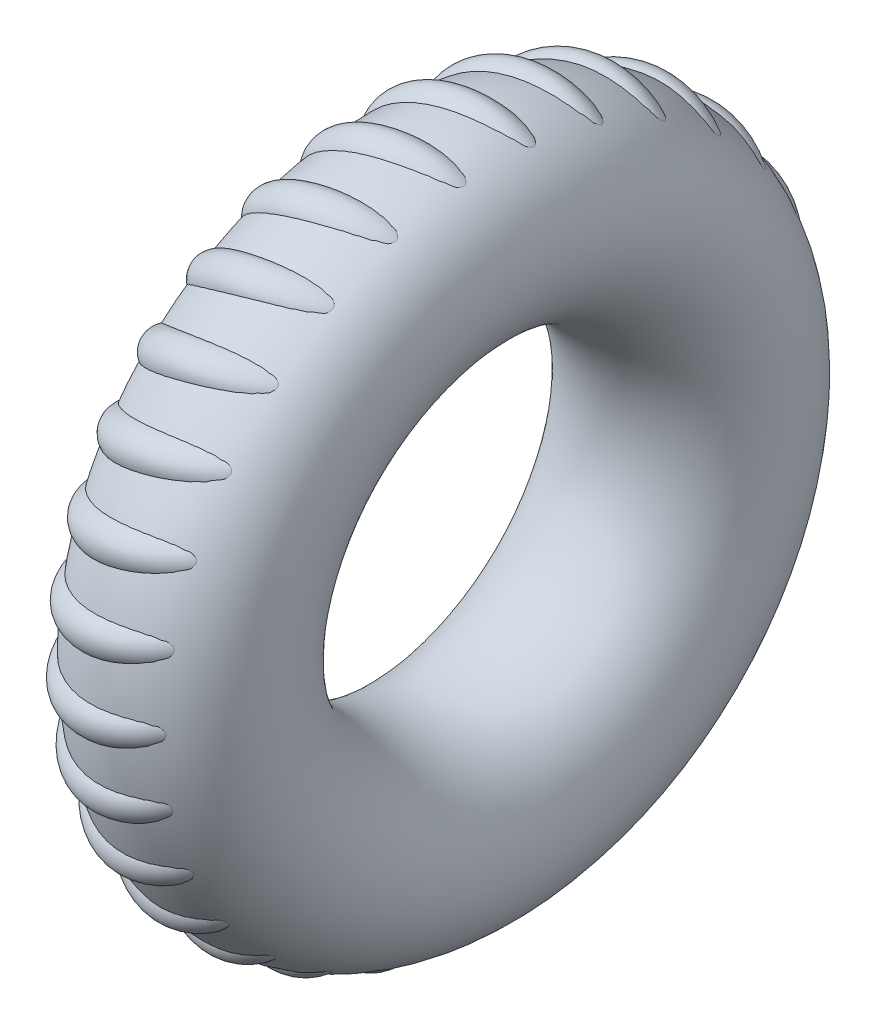
ISO-10303-21;
HEADER;
FILE_DESCRIPTION(('STEP AP214'),'2;1');
FILE_NAME('part.step','',(''),(''),'','','');
FILE_SCHEMA(('AUTOMOTIVE_DESIGN { 1 0 10303 214 1 1 1 1 }'));
ENDSEC;
DATA;
#1=APPLICATION_CONTEXT('core data for automotive mechanical design processes');
#2=APPLICATION_PROTOCOL_DEFINITION('international standard','automotive_design',2000,#1);
#3=PRODUCT_CONTEXT('',#1,'mechanical');
#4=PRODUCT('Part','Part','',(#3));
#5=PRODUCT_RELATED_PRODUCT_CATEGORY('part','',(#4));
#6=PRODUCT_DEFINITION_FORMATION('','',#4);
#7=PRODUCT_DEFINITION_CONTEXT('part definition',#1,'design');
#8=PRODUCT_DEFINITION('design','',#6,#7);
#9=PRODUCT_DEFINITION_SHAPE('','',#8);
#10=(LENGTH_UNIT() NAMED_UNIT(*) SI_UNIT(.MILLI.,.METRE.));
#11=(NAMED_UNIT(*) PLANE_ANGLE_UNIT() SI_UNIT($,.RADIAN.));
#12=(NAMED_UNIT(*) SI_UNIT($,.STERADIAN.) SOLID_ANGLE_UNIT());
#13=UNCERTAINTY_MEASURE_WITH_UNIT(LENGTH_MEASURE(1.E-05),#10,'distance_accuracy_value','');
#14=(GEOMETRIC_REPRESENTATION_CONTEXT(3) GLOBAL_UNCERTAINTY_ASSIGNED_CONTEXT((#13)) GLOBAL_UNIT_ASSIGNED_CONTEXT((#10,
#11,#12)) REPRESENTATION_CONTEXT('',''));
#15=CARTESIAN_POINT('',(0.,0.,0.));
#16=DIRECTION('',(0.,0.,1.));
#17=DIRECTION('',(1.,0.,0.));
#18=AXIS2_PLACEMENT_3D('',#15,#16,#17);
#19=CARTESIAN_POINT('',(-0.0197356871410002,0.807315676540417,-0.286027395869328));
#20=DIRECTION('',(0.171928492592131,0.065406256549393,0.982935712566803));
#21=DIRECTION('',(-0.0243779212002062,-0.997205374978762,0.0706198065095151));
#22=AXIS2_PLACEMENT_3D('',#19,#20,#21);
#23=TOROIDAL_SURFACE('',#22,0.234974875549106,0.0673045788176516);
#24=CARTESIAN_POINT('',(-0.0271046318599944,0.505880979900239,-0.264680479290146));
#25=VERTEX_POINT('',#24);
#26=VERTEX_LOOP('',#25);
#27=FACE_BOUND('',#26,.T.);
#28=ADVANCED_FACE('F47',(#27),#23,.T.);
#29=CLOSED_SHELL('',(#28));
#30=MANIFOLD_SOLID_BREP('B2',#29);
#31=CARTESIAN_POINT('',(-0.0197356871410384,0.730205452547386,-0.447627378346935));
#32=DIRECTION('',(0.171928492592131,0.268340798881693,0.94785748353355));
#33=DIRECTION('',(-0.0243779212002065,-0.960731361597714,0.276407249905959));
#34=AXIS2_PLACEMENT_3D('',#31,#32,#33);
#35=TOROIDAL_SURFACE('',#34,0.234974875549106,0.0673045788176516);
#36=CARTESIAN_POINT('',(-0.0271046318600326,0.439796100770597,-0.364075145662345));
#37=VERTEX_POINT('',#36);
#38=VERTEX_LOOP('',#37);
#39=FACE_BOUND('',#38,.T.);
#40=ADVANCED_FACE('F71',(#39),#35,.T.);
#41=CLOSED_SHELL('',(#40));
#42=MANIFOLD_SOLID_BREP('B6',#41);
#43=CARTESIAN_POINT('',(-0.0197356871409898,0.621181746363532,-0.589663896436287));
#44=DIRECTION('',(0.171928492592131,0.459547560660848,0.87135333414505));
#45=DIRECTION('',(-0.0243779212002064,-0.882268777614285,0.470114370132374));
#46=AXIS2_PLACEMENT_3D('',#43,#44,#45);
#47=TOROIDAL_SURFACE('',#46,0.234974875549106,0.0673045788176516);
#48=CARTESIAN_POINT('',(-0.027104631859984,0.35449002166146,-0.447557981142701));
#49=VERTEX_POINT('',#48);
#50=VERTEX_LOOP('',#49);
#51=FACE_BOUND('',#50,.T.);
#52=ADVANCED_FACE('F95',(#51),#47,.T.);
#53=CLOSED_SHELL('',(#52));
#54=MANIFOLD_SOLID_BREP('B43',#53);
#55=CARTESIAN_POINT('',(-0.0197356871409655,0.485009417102854,-0.70592927273007));
#56=DIRECTION('',(0.171928492592131,0.630669888885266,0.756766862837214));
#57=DIRECTION('',(-0.0243779212002064,-0.765246814453812,0.643275236524969));
#58=AXIS2_PLACEMENT_3D('',#55,#56,#57);
#59=TOROIDAL_SURFACE('',#58,0.234974875549106,0.0673045788176516);
#60=CARTESIAN_POINT('',(-0.0271046318599597,0.253691027573857,-0.511480385225655));
#61=VERTEX_POINT('',#60);
#62=VERTEX_LOOP('',#61);
#63=FACE_BOUND('',#62,.T.);
#64=ADVANCED_FACE('F119',(#63),#59,.T.);
#65=CLOSED_SHELL('',(#64));
#66=MANIFOLD_SOLID_BREP('B67',#65);
#67=CARTESIAN_POINT('',(-0.0197356871410211,0.327639848981404,-0.791342152381086));
#68=DIRECTION('',(0.171928492592131,0.774228916675515,0.609106048253082));
#69=DIRECTION('',(-0.0243779212002065,-0.614779893440078,0.788321888304371));
#70=AXIS2_PLACEMENT_3D('',#67,#68,#69);
#71=TOROIDAL_SURFACE('',#70,0.234974875549106,0.0673045788176516);
#72=CARTESIAN_POINT('',(-0.0271046318600153,0.141804518236684,-0.553048642119069));
#73=VERTEX_POINT('',#72);
#74=VERTEX_LOOP('',#73);
#75=FACE_BOUND('',#74,.T.);
#76=ADVANCED_FACE('F143',(#75),#71,.T.);
#77=CLOSED_SHELL('',(#76));
#78=MANIFOLD_SOLID_BREP('B91',#77);
#79=CARTESIAN_POINT('',(-0.0197356871410419,0.155950847269049,-0.842169582692097));
#80=DIRECTION('',(0.171928492592131,0.883950425644513,0.434824376545198));
#81=DIRECTION('',(-0.0243779212002064,-0.437444141041786,0.898915090776753));
#82=AXIS2_PLACEMENT_3D('',#79,#80,#81);
#83=TOROIDAL_SURFACE('',#82,0.234974875549106,0.0673045788176516);
#84=CARTESIAN_POINT('',(-0.0271046318600361,0.0237204709990027,-0.570446019530056));
#85=VERTEX_POINT('',#84);
#86=VERTEX_LOOP('',#85);
#87=FACE_BOUND('',#86,.T.);
#88=ADVANCED_FACE('F167',(#87),#83,.T.);
#89=CLOSED_SHELL('',(#88));
#90=MANIFOLD_SOLID_BREP('B115',#89);
#91=CARTESIAN_POINT('',(-0.019735687141028,-0.0225539548041886,-0.856190161061435));
#92=DIRECTION('',(0.171928492592131,0.955039059348089,0.241538793063432));
#93=DIRECTION('',(-0.0243779212002064,-0.240989980590085,0.970221390309017));
#94=AXIS2_PLACEMENT_3D('',#91,#92,#93);
#95=TOROIDAL_SURFACE('',#94,0.234974875549106,0.0673045788176516);
#96=CARTESIAN_POINT('',(-0.0271046318600222,-0.0954002746448148,-0.562912168583868));
#97=VERTEX_POINT('',#96);
#98=VERTEX_LOOP('',#97);
#99=FACE_BOUND('',#98,.T.);
#100=ADVANCED_FACE('F191',(#99),#95,.T.);
#101=CLOSED_SHELL('',(#100));
#102=MANIFOLD_SOLID_BREP('B139',#101);
#103=CARTESIAN_POINT('',(-0.0197356871410211,-0.200073040826566,-0.83279112093616));
#104=DIRECTION('',(0.171928492592132,0.984387903372301,0.037696805293071));
#105=DIRECTION('',(-0.0243779212002066,-0.0340034015883718,0.999124359446008));
#106=AXIS2_PLACEMENT_3D('',#103,#104,#105);
#107=TOROIDAL_SURFACE('',#106,0.234974875549106,0.0673045788176516);
#108=CARTESIAN_POINT('',(-0.0271046318600153,-0.210351570505313,-0.530776354718285));
#109=VERTEX_POINT('',#108);
#110=VERTEX_LOOP('',#109);
#111=FACE_BOUND('',#110,.T.);
#112=ADVANCED_FACE('F215',(#111),#107,.T.);
#113=CLOSED_SHELL('',(#112));
#114=MANIFOLD_SOLID_BREP('B163',#113);
#115=CARTESIAN_POINT('',(-0.0197356871410662,-0.368847974907889,-0.77299511265082));
#116=DIRECTION('',(0.171928492592131,0.970714272401901,-0.167792713757937));
#117=DIRECTION('',(-0.0243779212002063,0.174469289229176,0.984360799744611));
#118=AXIS2_PLACEMENT_3D('',#115,#116,#117);
#119=TOROIDAL_SURFACE('',#118,0.234974875549106,0.0673045788176516);
#120=CARTESIAN_POINT('',(-0.0271046318600603,-0.316109493355938,-0.475443067203995));
#121=VERTEX_POINT('',#120);
#122=VERTEX_LOOP('',#121);
#123=FACE_BOUND('',#122,.T.);
#124=ADVANCED_FACE('F239',(#123),#119,.T.);
#125=CLOSED_SHELL('',(#124));
#126=MANIFOLD_SOLID_BREP('B187',#125);
#127=CARTESIAN_POINT('',(-0.0197356871410662,-0.521502482556772,-0.67941550870055));
#128=DIRECTION('',(0.171928492592131,0.914615769723673,-0.365948886058952));
#129=DIRECTION('',(-0.0243779212002063,0.375316834910877,0.926575949607195));
#130=AXIS2_PLACEMENT_3D('',#127,#128,#129);
#131=TOROIDAL_SURFACE('',#130,0.234974875549106,0.0673045788176516);
#132=CARTESIAN_POINT('',(-0.0271046318600603,-0.408051914485254,-0.399330636223927));
#133=VERTEX_POINT('',#132);
#134=VERTEX_LOOP('',#133);
#135=FACE_BOUND('',#134,.T.);
#136=ADVANCED_FACE('F263',(#135),#131,.T.);
#137=CLOSED_SHELL('',(#136));
#138=MANIFOLD_SOLID_BREP('B211',#137);
#139=CARTESIAN_POINT('',(-0.0197356871410488,-0.651364829271361,-0.556142186822745));
#140=DIRECTION('',(0.171928492592132,0.818544169095114,-0.548111336021613));
#141=DIRECTION('',(-0.0243779212002062,0.559761233936978,0.828295284267237));
#142=AXIS2_PLACEMENT_3D('',#139,#140,#141);
#143=TOROIDAL_SURFACE('',#142,0.234974875549106,0.0673045788176516);
#144=CARTESIAN_POINT('',(-0.0271046318600429,-0.482160508901229,-0.305765540239886));
#145=VERTEX_POINT('',#144);
#146=VERTEX_LOOP('',#145);
#147=FACE_BOUND('',#146,.T.);
#148=ADVANCED_FACE('F287',(#147),#143,.T.);
#149=CLOSED_SHELL('',(#148));
#150=MANIFOLD_SOLID_BREP('B235',#149);
#151=CARTESIAN_POINT('',(-0.019735687140976,-0.752759407351554,-0.408562782714491));
#152=DIRECTION('',(0.171928492592131,0.686698260466392,-0.706318690470122));
#153=DIRECTION('',(-0.0243779212002063,0.719741381007625,0.693814140403049));
#154=AXIS2_PLACEMENT_3D('',#151,#152,#153);
#155=TOROIDAL_SURFACE('',#154,0.234974875549106,0.0673045788176516);
#156=CARTESIAN_POINT('',(-0.0271046318599701,-0.535196375415393,-0.198837022921517));
#157=VERTEX_POINT('',#156);
#158=VERTEX_LOOP('',#157);
#159=FACE_BOUND('',#158,.T.);
#160=ADVANCED_FACE('F311',(#159),#155,.T.);
#161=CLOSED_SHELL('',(#160));
#162=MANIFOLD_SOLID_BREP('B259',#161);
#163=CARTESIAN_POINT('',(-0.0197356871410558,-0.821254787190112,-0.243127224499853));
#164=DIRECTION('',(0.171928492592131,0.524840342711451,-0.833656528851984));
#165=DIRECTION('',(-0.0243779212002063,0.848265376025916,0.529009989313627));
#166=AXIS2_PLACEMENT_3D('',#163,#164,#165);
#167=TOROIDAL_SURFACE('',#166,0.234974875549106,0.0673045788176516);
#168=CARTESIAN_POINT('',(-0.0271046318600499,-0.564841592166786,-0.0832183735755656));
#169=VERTEX_POINT('',#168);
#170=VERTEX_LOOP('',#169);
#171=FACE_BOUND('',#170,.T.);
#172=ADVANCED_FACE('F335',(#171),#167,.T.);
#173=CLOSED_SHELL('',(#172));
#174=MANIFOLD_SOLID_BREP('B283',#173);
#175=CARTESIAN_POINT('',(-0.0197356871410176,-0.853857392010743,-0.0670658399207283));
#176=DIRECTION('',(0.171928492592132,0.340044383516628,-0.924559576595148));
#177=DIRECTION('',(-0.0243779212002063,0.939716103682979,0.341085563219633));
#178=AXIS2_PLACEMENT_3D('',#175,#176,#177);
#179=TOROIDAL_SURFACE('',#178,0.234974875549106,0.0673045788176516);
#180=CARTESIAN_POINT('',(-0.0271046318600118,-0.569800520929797,0.0360373180216806));
#181=VERTEX_POINT('',#180);
#182=VERTEX_LOOP('',#181);
#183=FACE_BOUND('',#182,.T.);
#184=ADVANCED_FACE('F359',(#183),#179,.T.);
#185=CLOSED_SHELL('',(#184));
#186=MANIFOLD_SOLID_BREP('B307',#185);
#187=CARTESIAN_POINT('',(-0.0197356871410592,-0.849142331538183,0.111926643680551));
#188=DIRECTION('',(0.17192849259213,0.14038685304814,-0.975054934312033));
#189=DIRECTION('',(-0.0243779212002062,0.990096728350951,0.138254061302813));
#190=AXIS2_PLACEMENT_3D('',#187,#188,#189);
#191=TOROIDAL_SURFACE('',#190,0.234974875549106,0.0673045788176516);
#192=CARTESIAN_POINT('',(-0.0271046318600533,-0.549856432721946,0.153718005895153));
#193=VERTEX_POINT('',#192);
#194=VERTEX_LOOP('',#193);
#195=FACE_BOUND('',#194,.T.);
#196=ADVANCED_FACE('F383',(#195),#191,.T.);
#197=CLOSED_SHELL('',(#196));
#198=MANIFOLD_SOLID_BREP('B331',#197);
#199=CARTESIAN_POINT('',(-0.0197356871409864,-0.80731567654041,0.286027395869329));
#200=DIRECTION('',(0.17192849259213,-0.0654062565494007,-0.982935712566803));
#201=DIRECTION('',(-0.0243779212002061,0.997205374978758,-0.0706198065095193));
#202=AXIS2_PLACEMENT_3D('',#199,#200,#201);
#203=TOROIDAL_SURFACE('',#202,0.234974875549106,0.0673045788176516);
#204=CARTESIAN_POINT('',(-0.0271046318599805,-0.505880979900234,0.264680479290145));
#205=VERTEX_POINT('',#204);
#206=VERTEX_LOOP('',#205);
#207=FACE_BOUND('',#206,.T.);
#208=ADVANCED_FACE('F407',(#207),#203,.T.);
#209=CLOSED_SHELL('',(#208));
#210=MANIFOLD_SOLID_BREP('B355',#209);
#211=CARTESIAN_POINT('',(-0.0197356871409586,-0.730205452547379,0.447627378346934));
#212=DIRECTION('',(0.171928492592131,-0.268340798881699,-0.947857483533548));
#213=DIRECTION('',(-0.0243779212002062,0.960731361597708,-0.276407249905965));
#214=AXIS2_PLACEMENT_3D('',#211,#212,#213);
#215=TOROIDAL_SURFACE('',#214,0.234974875549106,0.0673045788176516);
#216=CARTESIAN_POINT('',(-0.0271046318599527,-0.439796100770592,0.364075145662343));
#217=VERTEX_POINT('',#216);
#218=VERTEX_LOOP('',#217);
#219=FACE_BOUND('',#218,.T.);
#220=ADVANCED_FACE('F431',(#219),#215,.T.);
#221=CLOSED_SHELL('',(#220));
#222=MANIFOLD_SOLID_BREP('B379',#221);
#223=CARTESIAN_POINT('',(-0.0197356871409725,-0.621181746363539,0.589663896436287));
#224=DIRECTION('',(0.171928492592131,-0.459547560660852,-0.871353334145048));
#225=DIRECTION('',(-0.0243779212002062,0.882268777614277,-0.470114370132379));
#226=AXIS2_PLACEMENT_3D('',#223,#224,#225);
#227=TOROIDAL_SURFACE('',#226,0.234974875549106,0.0673045788176516);
#228=CARTESIAN_POINT('',(-0.0271046318599666,-0.35449002166147,0.4475579811427));
#229=VERTEX_POINT('',#228);
#230=VERTEX_LOOP('',#229);
#231=FACE_BOUND('',#230,.T.);
#232=ADVANCED_FACE('F455',(#231),#227,.T.);
#233=CLOSED_SHELL('',(#232));
#234=MANIFOLD_SOLID_BREP('B403',#233);
#235=CARTESIAN_POINT('',(-0.0197356871410349,-0.485009417102882,0.705929272730075));
#236=DIRECTION('',(0.171928492592131,-0.63066988888527,-0.75676686283721));
#237=DIRECTION('',(-0.024377921200206,0.765246814453802,-0.643275236524974));
#238=AXIS2_PLACEMENT_3D('',#235,#236,#237);
#239=TOROIDAL_SURFACE('',#238,0.234974875549106,0.0673045788176516);
#240=CARTESIAN_POINT('',(-0.027104631860029,-0.253691027573887,0.511480385225659));
#241=VERTEX_POINT('',#240);
#242=VERTEX_LOOP('',#241);
#243=FACE_BOUND('',#242,.T.);
#244=ADVANCED_FACE('F479',(#243),#239,.T.);
#245=CLOSED_SHELL('',(#244));
#246=MANIFOLD_SOLID_BREP('B427',#245);
#247=CARTESIAN_POINT('',(-0.0197356871410349,-0.327639848981438,0.791342152381083));
#248=DIRECTION('',(0.171928492592131,-0.774228916675517,-0.609106048253079));
#249=DIRECTION('',(-0.0243779212002061,0.614779893440069,-0.788321888304371));
#250=AXIS2_PLACEMENT_3D('',#247,#248,#249);
#251=TOROIDAL_SURFACE('',#250,0.234974875549106,0.0673045788176516);
#252=CARTESIAN_POINT('',(-0.027104631860029,-0.141804518236721,0.553048642119066));
#253=VERTEX_POINT('',#252);
#254=VERTEX_LOOP('',#253);
#255=FACE_BOUND('',#254,.T.);
#256=ADVANCED_FACE('F503',(#255),#251,.T.);
#257=CLOSED_SHELL('',(#256));
#258=MANIFOLD_SOLID_BREP('B451',#257);
#259=CARTESIAN_POINT('',(-0.0197356871410211,-0.155950847269042,0.842169582692093));
#260=DIRECTION('',(0.171928492592131,-0.883950425644512,-0.434824376545191));
#261=DIRECTION('',(-0.0243779212002063,0.437444141041777,-0.898915090776753));
#262=AXIS2_PLACEMENT_3D('',#259,#260,#261);
#263=TOROIDAL_SURFACE('',#262,0.234974875549106,0.0673045788176516);
#264=CARTESIAN_POINT('',(-0.0271046318600152,-0.0237204709989985,0.570446019530052));
#265=VERTEX_POINT('',#264);
#266=VERTEX_LOOP('',#265);
#267=FACE_BOUND('',#266,.T.);
#268=ADVANCED_FACE('F527',(#267),#263,.T.);
#269=CLOSED_SHELL('',(#268));
#270=MANIFOLD_SOLID_BREP('B475',#269);
#271=CARTESIAN_POINT('',(-0.019735687141028,0.0225539548041817,0.856190161061433));
#272=DIRECTION('',(0.171928492592131,-0.955039059348087,-0.241538793063426));
#273=DIRECTION('',(-0.0243779212002064,0.240989980590075,-0.970221390309017));
#274=AXIS2_PLACEMENT_3D('',#271,#272,#273);
#275=TOROIDAL_SURFACE('',#274,0.234974875549106,0.0673045788176516);
#276=CARTESIAN_POINT('',(-0.0271046318600222,0.0954002746448051,0.562912168583867));
#277=VERTEX_POINT('',#276);
#278=VERTEX_LOOP('',#277);
#279=FACE_BOUND('',#278,.T.);
#280=ADVANCED_FACE('F551',(#279),#275,.T.);
#281=CLOSED_SHELL('',(#280));
#282=MANIFOLD_SOLID_BREP('B499',#281);
#283=CARTESIAN_POINT('',(-0.0197356871410592,0.200073040826573,0.832791120936155));
#284=DIRECTION('',(0.171928492592131,-0.984387903372297,-0.0376968052930659));
#285=DIRECTION('',(-0.0243779212002061,0.0340034015883631,-0.999124359446005));
#286=AXIS2_PLACEMENT_3D('',#283,#284,#285);
#287=TOROIDAL_SURFACE('',#286,0.234974875549106,0.0673045788176516);
#288=CARTESIAN_POINT('',(-0.0271046318600533,0.210351570505317,0.530776354718281));
#289=VERTEX_POINT('',#288);
#290=VERTEX_LOOP('',#289);
#291=FACE_BOUND('',#290,.T.);
#292=ADVANCED_FACE('F575',(#291),#287,.T.);
#293=CLOSED_SHELL('',(#292));
#294=MANIFOLD_SOLID_BREP('B523',#293);
#295=CARTESIAN_POINT('',(-0.0197356871410315,0.368847974907875,0.772995112650809));
#296=DIRECTION('',(0.171928492592131,-0.970714272401894,0.167792713757942));
#297=DIRECTION('',(-0.0243779212002061,-0.174469289229184,-0.984360799744611));
#298=AXIS2_PLACEMENT_3D('',#295,#296,#297);
#299=TOROIDAL_SURFACE('',#298,0.234974875549106,0.0673045788176516);
#300=CARTESIAN_POINT('',(-0.0271046318600256,0.316109493355921,0.475443067203983));
#301=VERTEX_POINT('',#300);
#302=VERTEX_LOOP('',#301);
#303=FACE_BOUND('',#302,.T.);
#304=ADVANCED_FACE('F599',(#303),#299,.T.);
#305=CLOSED_SHELL('',(#304));
#306=MANIFOLD_SOLID_BREP('B547',#305);
#307=CARTESIAN_POINT('',(-0.01973568714091,0.521502482556758,0.679415508700554));
#308=DIRECTION('',(0.171928492592132,-0.914615769723665,0.365948886058955));
#309=DIRECTION('',(-0.0243779212002062,-0.375316834910883,-0.926575949607187));
#310=AXIS2_PLACEMENT_3D('',#307,#308,#309);
#311=TOROIDAL_SURFACE('',#310,0.234974875549106,0.0673045788176516);
#312=CARTESIAN_POINT('',(-0.0271046318599042,0.408051914485239,0.399330636223933));
#313=VERTEX_POINT('',#312);
#314=VERTEX_LOOP('',#313);
#315=FACE_BOUND('',#314,.T.);
#316=ADVANCED_FACE('F623',(#315),#311,.T.);
#317=CLOSED_SHELL('',(#316));
#318=MANIFOLD_SOLID_BREP('B571',#317);
#319=CARTESIAN_POINT('',(-0.0197356871410002,0.651364829271361,0.55614218682273));
#320=DIRECTION('',(0.17192849259213,-0.818544169095105,0.54811133602161));
#321=DIRECTION('',(-0.0243779212002063,-0.559761233936983,-0.828295284267232));
#322=AXIS2_PLACEMENT_3D('',#319,#320,#321);
#323=TOROIDAL_SURFACE('',#322,0.234974875549106,0.0673045788176516);
#324=CARTESIAN_POINT('',(-0.0271046318599944,0.482160508901228,0.305765540239873));
#325=VERTEX_POINT('',#324);
#326=VERTEX_LOOP('',#325);
#327=FACE_BOUND('',#326,.T.);
#328=ADVANCED_FACE('F647',(#327),#323,.T.);
#329=CLOSED_SHELL('',(#328));
#330=MANIFOLD_SOLID_BREP('B595',#329);
#331=CARTESIAN_POINT('',(-0.019735687140976,0.752759407351575,0.408562782714496));
#332=DIRECTION('',(0.171928492592131,-0.686698260466381,0.70631869047012));
#333=DIRECTION('',(-0.0243779212002062,-0.719741381007629,-0.693814140403047));
#334=AXIS2_PLACEMENT_3D('',#331,#332,#333);
#335=TOROIDAL_SURFACE('',#334,0.234974875549106,0.0673045788176516);
#336=CARTESIAN_POINT('',(-0.0271046318599701,0.535196375415412,0.198837022921522));
#337=VERTEX_POINT('',#336);
#338=VERTEX_LOOP('',#337);
#339=FACE_BOUND('',#338,.T.);
#340=ADVANCED_FACE('F671',(#339),#335,.T.);
#341=CLOSED_SHELL('',(#340));
#342=MANIFOLD_SOLID_BREP('B619',#341);
#343=CARTESIAN_POINT('',(-0.0197356871409586,0.821254787190098,0.243127224499862));
#344=DIRECTION('',(0.171928492592132,-0.524840342711443,0.833656528851977));
#345=DIRECTION('',(-0.0243779212002062,-0.848265376025917,-0.529009989313623));
#346=AXIS2_PLACEMENT_3D('',#343,#344,#345);
#347=TOROIDAL_SURFACE('',#346,0.234974875549106,0.0673045788176516);
#348=CARTESIAN_POINT('',(-0.0271046318599527,0.564841592166772,0.0832183735755764));
#349=VERTEX_POINT('',#348);
#350=VERTEX_LOOP('',#349);
#351=FACE_BOUND('',#350,.T.);
#352=ADVANCED_FACE('F695',(#351),#347,.T.);
#353=CLOSED_SHELL('',(#352));
#354=MANIFOLD_SOLID_BREP('B643',#353);
#355=CARTESIAN_POINT('',(-0.0197356871409933,0.853857392010757,0.0670658399207314));
#356=DIRECTION('',(0.171928492592131,-0.340044383516622,0.924559576595148));
#357=DIRECTION('',(-0.0243779212002061,-0.939716103682982,-0.341085563219629));
#358=AXIS2_PLACEMENT_3D('',#355,#356,#357);
#359=TOROIDAL_SURFACE('',#358,0.234974875549106,0.0673045788176516);
#360=CARTESIAN_POINT('',(-0.0271046318599874,0.56980052092981,-0.0360373180216761));
#361=VERTEX_POINT('',#360);
#362=VERTEX_LOOP('',#361);
#363=FACE_BOUND('',#362,.T.);
#364=ADVANCED_FACE('F719',(#363),#359,.T.);
#365=CLOSED_SHELL('',(#364));
#366=MANIFOLD_SOLID_BREP('B667',#365);
#367=CARTESIAN_POINT('',(-0.0197356871409482,0.84914233153819,-0.111926643680538));
#368=DIRECTION('',(0.171928492592132,-0.14038685304814,0.975054934312027));
#369=DIRECTION('',(-0.0243779212002063,-0.990096728350951,-0.138254061302813));
#370=AXIS2_PLACEMENT_3D('',#367,#368,#369);
#371=TOROIDAL_SURFACE('',#370,0.234974875549106,0.0673045788176516);
#372=CARTESIAN_POINT('',(-0.0271046318599424,0.549856432721953,-0.15371800589514));
#373=VERTEX_POINT('',#372);
#374=VERTEX_LOOP('',#373);
#375=FACE_BOUND('',#374,.T.);
#376=ADVANCED_FACE('F743',(#375),#371,.T.);
#377=CLOSED_SHELL('',(#376));
#378=MANIFOLD_SOLID_BREP('B691',#377);
#379=CARTESIAN_POINT('',(0.,0.818475865858184,0.));
#380=DIRECTION('',(0.,0.,-1.));
#381=DIRECTION('',(0.864501466631609,0.502630295736138,0.));
#382=AXIS2_PLACEMENT_3D('',#379,#380,#381);
#383=ELLIPSE('',#382,0.321785299721557,0.306558502350494);
#384=CARTESIAN_POINT('',(0.318007281677431,0.,0.));
#385=DIRECTION('',(-1.,0.,0.));
#386=AXIS1_PLACEMENT('',#384,#385);
#387=SURFACE_OF_REVOLUTION('',#383,#386);
#388=ADVANCED_FACE('F759',(),#387,.F.);
#389=CLOSED_SHELL('',(#388));
#390=MANIFOLD_SOLID_BREP('B715_NOT_SHOWN',#389);
#391=ADVANCED_BREP_SHAPE_REPRESENTATION('',(#18,#30,#42,#54,#66,#78,#90,#102,#114,#126,#138,
#150,#162,#174,#186,#198,#210,#222,#234,#246,#258,#270,#282,#294,#306,#318,#330,#342,#354,#366,
#378,#390),#14);
#392=SHAPE_DEFINITION_REPRESENTATION(#9,#391);
ENDSEC;
END-ISO-10303-21;
